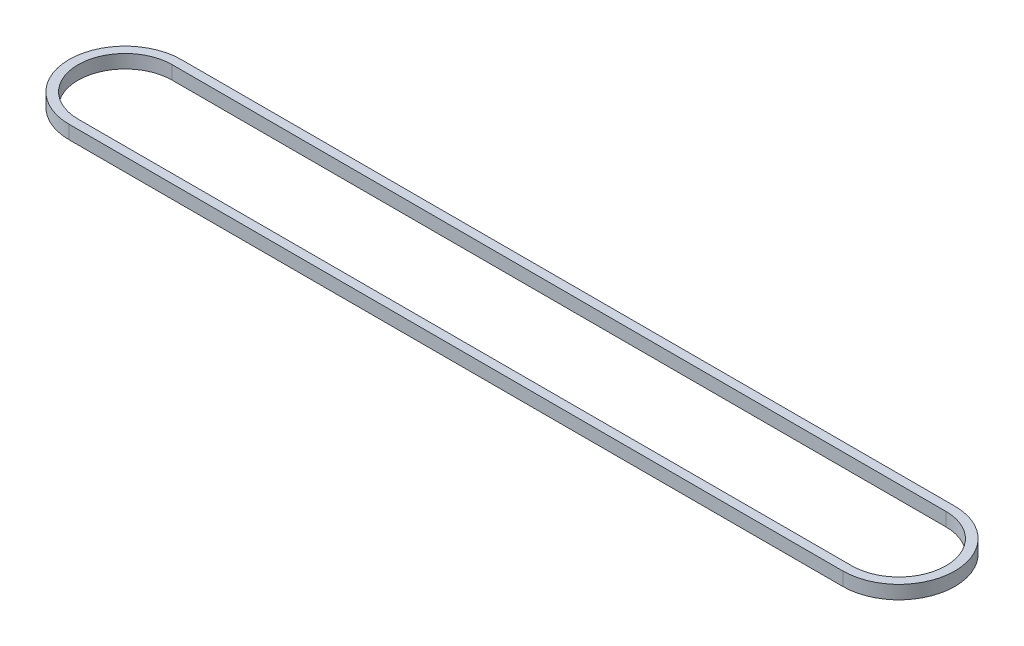
ISO-10303-21;
HEADER;
FILE_DESCRIPTION(('STEP AP214'),'2;1');
FILE_NAME('part.step','',(''),(''),'','','');
FILE_SCHEMA(('AUTOMOTIVE_DESIGN { 1 0 10303 214 1 1 1 1 }'));
ENDSEC;
DATA;
#1=APPLICATION_CONTEXT('core data for automotive mechanical design processes');
#2=APPLICATION_PROTOCOL_DEFINITION('international standard','automotive_design',2000,#1);
#3=PRODUCT_CONTEXT('',#1,'mechanical');
#4=PRODUCT('Part','Part','',(#3));
#5=PRODUCT_RELATED_PRODUCT_CATEGORY('part','',(#4));
#6=PRODUCT_DEFINITION_FORMATION('','',#4);
#7=PRODUCT_DEFINITION_CONTEXT('part definition',#1,'design');
#8=PRODUCT_DEFINITION('design','',#6,#7);
#9=PRODUCT_DEFINITION_SHAPE('','',#8);
#10=(LENGTH_UNIT() NAMED_UNIT(*) SI_UNIT(.MILLI.,.METRE.));
#11=(NAMED_UNIT(*) PLANE_ANGLE_UNIT() SI_UNIT($,.RADIAN.));
#12=(NAMED_UNIT(*) SI_UNIT($,.STERADIAN.) SOLID_ANGLE_UNIT());
#13=UNCERTAINTY_MEASURE_WITH_UNIT(LENGTH_MEASURE(1.E-05),#10,'distance_accuracy_value','');
#14=(GEOMETRIC_REPRESENTATION_CONTEXT(3) GLOBAL_UNCERTAINTY_ASSIGNED_CONTEXT((#13)) GLOBAL_UNIT_ASSIGNED_CONTEXT((#10,
#11,#12)) REPRESENTATION_CONTEXT('',''));
#15=CARTESIAN_POINT('',(0.,0.,0.));
#16=DIRECTION('',(0.,0.,1.));
#17=DIRECTION('',(1.,0.,0.));
#18=AXIS2_PLACEMENT_3D('',#15,#16,#17);
#19=CARTESIAN_POINT('',(-32.6689284068016,3.,0.));
#20=DIRECTION('',(0.,1.,0.));
#21=DIRECTION('',(0.,0.,1.));
#22=AXIS2_PLACEMENT_3D('',#19,#20,#21);
#23=PLANE('',#22);
#24=CARTESIAN_POINT('',(-32.6689284068016,3.,0.));
#25=DIRECTION('',(0.,1.,0.));
#26=DIRECTION('',(0.,0.,1.));
#27=AXIS2_PLACEMENT_3D('',#24,#25,#26);
#28=CIRCLE('',#27,12.5);
#29=CARTESIAN_POINT('',(-32.6689284068016,3.,-12.5));
#30=VERTEX_POINT('',#29);
#31=CARTESIAN_POINT('',(-32.6689284068016,3.,12.5));
#32=VERTEX_POINT('',#31);
#33=EDGE_CURVE('E133',#30,#32,#28,.T.);
#34=ORIENTED_EDGE('',*,*,#33,.T.);
#35=DIRECTION('',(1.,0.,0.));
#36=VECTOR('',#35,1.);
#37=CARTESIAN_POINT('',(-32.6689284068016,3.,12.5));
#38=LINE('',#37,#36);
#39=CARTESIAN_POINT('',(139.831071593198,3.,12.5));
#40=VERTEX_POINT('',#39);
#41=EDGE_CURVE('E136',#32,#40,#38,.T.);
#42=ORIENTED_EDGE('',*,*,#41,.T.);
#43=CARTESIAN_POINT('',(139.831071593198,3.,0.));
#44=DIRECTION('',(0.,1.,0.));
#45=DIRECTION('',(0.,0.,1.));
#46=AXIS2_PLACEMENT_3D('',#43,#44,#45);
#47=CIRCLE('',#46,12.5);
#48=CARTESIAN_POINT('',(139.831071593198,3.,-12.5));
#49=VERTEX_POINT('',#48);
#50=EDGE_CURVE('E139',#40,#49,#47,.T.);
#51=ORIENTED_EDGE('',*,*,#50,.T.);
#52=DIRECTION('',(-1.,0.,0.));
#53=VECTOR('',#52,1.);
#54=CARTESIAN_POINT('',(-32.6689284068016,3.,-12.5));
#55=LINE('',#54,#53);
#56=EDGE_CURVE('E141',#49,#30,#55,.T.);
#57=ORIENTED_EDGE('',*,*,#56,.T.);
#58=EDGE_LOOP('',(#34,#42,#51,#57));
#59=FACE_BOUND('',#58,.T.);
#60=DIRECTION('',(1.,0.,0.));
#61=VECTOR('',#60,1.);
#62=CARTESIAN_POINT('',(-32.6689284068016,3.,10.5));
#63=LINE('',#62,#61);
#64=CARTESIAN_POINT('',(-32.6689284068016,3.,10.5));
#65=VERTEX_POINT('',#64);
#66=CARTESIAN_POINT('',(139.831071593198,3.,10.5));
#67=VERTEX_POINT('',#66);
#68=EDGE_CURVE('E105',#65,#67,#63,.T.);
#69=ORIENTED_EDGE('',*,*,#68,.F.);
#70=CARTESIAN_POINT('',(-32.6689284068016,3.,0.));
#71=DIRECTION('',(0.,1.,0.));
#72=DIRECTION('',(0.,0.,1.));
#73=AXIS2_PLACEMENT_3D('',#70,#71,#72);
#74=CIRCLE('',#73,10.5);
#75=CARTESIAN_POINT('',(-32.6689284068016,3.,-10.5));
#76=VERTEX_POINT('',#75);
#77=EDGE_CURVE('E97',#76,#65,#74,.T.);
#78=ORIENTED_EDGE('',*,*,#77,.F.);
#79=DIRECTION('',(-1.,0.,0.));
#80=VECTOR('',#79,1.);
#81=CARTESIAN_POINT('',(-32.6689284068016,3.,-10.5));
#82=LINE('',#81,#80);
#83=CARTESIAN_POINT('',(139.831071593198,3.,-10.5));
#84=VERTEX_POINT('',#83);
#85=EDGE_CURVE('E119',#84,#76,#82,.T.);
#86=ORIENTED_EDGE('',*,*,#85,.F.);
#87=CARTESIAN_POINT('',(139.831071593198,3.,0.));
#88=DIRECTION('',(0.,1.,0.));
#89=DIRECTION('',(0.,0.,1.));
#90=AXIS2_PLACEMENT_3D('',#87,#88,#89);
#91=CIRCLE('',#90,10.5);
#92=EDGE_CURVE('E117',#67,#84,#91,.T.);
#93=ORIENTED_EDGE('',*,*,#92,.F.);
#94=EDGE_LOOP('',(#69,#78,#86,#93));
#95=FACE_BOUND('',#94,.T.);
#96=ADVANCED_FACE('F32',(#59,#95),#23,.T.);
#97=CARTESIAN_POINT('',(-32.6689284068016,0.,0.));
#98=DIRECTION('',(0.,1.,0.));
#99=DIRECTION('',(0.,0.,1.));
#100=AXIS2_PLACEMENT_3D('',#97,#98,#99);
#101=PLANE('',#100);
#102=CARTESIAN_POINT('',(-32.6689284068016,0.,0.));
#103=DIRECTION('',(0.,1.,0.));
#104=DIRECTION('',(0.,0.,1.));
#105=AXIS2_PLACEMENT_3D('',#102,#103,#104);
#106=CIRCLE('',#105,12.5);
#107=CARTESIAN_POINT('',(-32.6689284068016,0.,-12.5));
#108=VERTEX_POINT('',#107);
#109=CARTESIAN_POINT('',(-32.6689284068016,0.,12.5));
#110=VERTEX_POINT('',#109);
#111=EDGE_CURVE('E113',#108,#110,#106,.T.);
#112=ORIENTED_EDGE('',*,*,#111,.F.);
#113=DIRECTION('',(-1.,0.,0.));
#114=VECTOR('',#113,1.);
#115=CARTESIAN_POINT('',(-32.6689284068016,0.,-12.5));
#116=LINE('',#115,#114);
#117=CARTESIAN_POINT('',(139.831071593198,0.,-12.5));
#118=VERTEX_POINT('',#117);
#119=EDGE_CURVE('E137',#118,#108,#116,.T.);
#120=ORIENTED_EDGE('',*,*,#119,.F.);
#121=CARTESIAN_POINT('',(139.831071593198,0.,0.));
#122=DIRECTION('',(0.,1.,0.));
#123=DIRECTION('',(0.,0.,1.));
#124=AXIS2_PLACEMENT_3D('',#121,#122,#123);
#125=CIRCLE('',#124,12.5);
#126=CARTESIAN_POINT('',(139.831071593198,0.,12.5));
#127=VERTEX_POINT('',#126);
#128=EDGE_CURVE('E148',#127,#118,#125,.T.);
#129=ORIENTED_EDGE('',*,*,#128,.F.);
#130=DIRECTION('',(1.,0.,0.));
#131=VECTOR('',#130,1.);
#132=CARTESIAN_POINT('',(-32.6689284068016,0.,12.5));
#133=LINE('',#132,#131);
#134=EDGE_CURVE('E146',#110,#127,#133,.T.);
#135=ORIENTED_EDGE('',*,*,#134,.F.);
#136=EDGE_LOOP('',(#112,#120,#129,#135));
#137=FACE_BOUND('',#136,.T.);
#138=CARTESIAN_POINT('',(-32.6689284068016,0.,0.));
#139=DIRECTION('',(0.,1.,0.));
#140=DIRECTION('',(0.,0.,1.));
#141=AXIS2_PLACEMENT_3D('',#138,#139,#140);
#142=CIRCLE('',#141,10.5);
#143=CARTESIAN_POINT('',(-32.6689284068016,0.,-10.5));
#144=VERTEX_POINT('',#143);
#145=CARTESIAN_POINT('',(-32.6689284068016,0.,10.5));
#146=VERTEX_POINT('',#145);
#147=EDGE_CURVE('E55',#144,#146,#142,.T.);
#148=ORIENTED_EDGE('',*,*,#147,.T.);
#149=DIRECTION('',(1.,0.,0.));
#150=VECTOR('',#149,1.);
#151=CARTESIAN_POINT('',(-32.6689284068016,0.,10.5));
#152=LINE('',#151,#150);
#153=CARTESIAN_POINT('',(139.831071593198,0.,10.5));
#154=VERTEX_POINT('',#153);
#155=EDGE_CURVE('E112',#146,#154,#152,.T.);
#156=ORIENTED_EDGE('',*,*,#155,.T.);
#157=CARTESIAN_POINT('',(139.831071593198,0.,0.));
#158=DIRECTION('',(0.,1.,0.));
#159=DIRECTION('',(0.,0.,1.));
#160=AXIS2_PLACEMENT_3D('',#157,#158,#159);
#161=CIRCLE('',#160,10.5);
#162=CARTESIAN_POINT('',(139.831071593198,0.,-10.5));
#163=VERTEX_POINT('',#162);
#164=EDGE_CURVE('E125',#154,#163,#161,.T.);
#165=ORIENTED_EDGE('',*,*,#164,.T.);
#166=DIRECTION('',(-1.,0.,0.));
#167=VECTOR('',#166,1.);
#168=CARTESIAN_POINT('',(-32.6689284068016,0.,-10.5));
#169=LINE('',#168,#167);
#170=EDGE_CURVE('E106',#163,#144,#169,.T.);
#171=ORIENTED_EDGE('',*,*,#170,.T.);
#172=EDGE_LOOP('',(#148,#156,#165,#171));
#173=FACE_BOUND('',#172,.T.);
#174=ADVANCED_FACE('F166',(#137,#173),#101,.F.);
#175=CARTESIAN_POINT('',(-32.6689284068016,3.,0.));
#176=DIRECTION('',(0.,-1.,0.));
#177=DIRECTION('',(0.,0.,-1.));
#178=AXIS2_PLACEMENT_3D('',#175,#176,#177);
#179=CYLINDRICAL_SURFACE('',#178,12.5);
#180=ORIENTED_EDGE('',*,*,#111,.T.);
#181=DIRECTION('',(0.,-1.,0.));
#182=VECTOR('',#181,1.);
#183=CARTESIAN_POINT('',(-32.6689284068016,3.,12.5));
#184=LINE('',#183,#182);
#185=EDGE_CURVE('E11',#32,#110,#184,.T.);
#186=ORIENTED_EDGE('',*,*,#185,.F.);
#187=ORIENTED_EDGE('',*,*,#33,.F.);
#188=DIRECTION('',(0.,-1.,0.));
#189=VECTOR('',#188,1.);
#190=CARTESIAN_POINT('',(-32.6689284068016,3.,-12.5));
#191=LINE('',#190,#189);
#192=EDGE_CURVE('E143',#30,#108,#191,.T.);
#193=ORIENTED_EDGE('',*,*,#192,.T.);
#194=EDGE_LOOP('',(#180,#186,#187,#193));
#195=FACE_BOUND('',#194,.T.);
#196=ADVANCED_FACE('F34',(#195),#179,.T.);
#197=CARTESIAN_POINT('',(-32.6689284068016,3.,12.5));
#198=DIRECTION('',(0.,0.,-1.));
#199=DIRECTION('',(-1.,0.,0.));
#200=AXIS2_PLACEMENT_3D('',#197,#198,#199);
#201=PLANE('',#200);
#202=ORIENTED_EDGE('',*,*,#134,.T.);
#203=DIRECTION('',(0.,-1.,0.));
#204=VECTOR('',#203,1.);
#205=CARTESIAN_POINT('',(139.831071593198,3.,12.5));
#206=LINE('',#205,#204);
#207=EDGE_CURVE('E40',#40,#127,#206,.T.);
#208=ORIENTED_EDGE('',*,*,#207,.F.);
#209=ORIENTED_EDGE('',*,*,#41,.F.);
#210=ORIENTED_EDGE('',*,*,#185,.T.);
#211=EDGE_LOOP('',(#202,#208,#209,#210));
#212=FACE_BOUND('',#211,.T.);
#213=ADVANCED_FACE('F176',(#212),#201,.F.);
#214=CARTESIAN_POINT('',(139.831071593198,3.,0.));
#215=DIRECTION('',(0.,-1.,0.));
#216=DIRECTION('',(0.,0.,-1.));
#217=AXIS2_PLACEMENT_3D('',#214,#215,#216);
#218=CYLINDRICAL_SURFACE('',#217,12.5);
#219=ORIENTED_EDGE('',*,*,#128,.T.);
#220=DIRECTION('',(0.,-1.,0.));
#221=VECTOR('',#220,1.);
#222=CARTESIAN_POINT('',(139.831071593198,3.,-12.5));
#223=LINE('',#222,#221);
#224=EDGE_CURVE('E153',#49,#118,#223,.T.);
#225=ORIENTED_EDGE('',*,*,#224,.F.);
#226=ORIENTED_EDGE('',*,*,#50,.F.);
#227=ORIENTED_EDGE('',*,*,#207,.T.);
#228=EDGE_LOOP('',(#219,#225,#226,#227));
#229=FACE_BOUND('',#228,.T.);
#230=ADVANCED_FACE('F160',(#229),#218,.T.);
#231=CARTESIAN_POINT('',(-32.6689284068016,3.,-12.5));
#232=DIRECTION('',(0.,0.,1.));
#233=DIRECTION('',(1.,0.,0.));
#234=AXIS2_PLACEMENT_3D('',#231,#232,#233);
#235=PLANE('',#234);
#236=ORIENTED_EDGE('',*,*,#119,.T.);
#237=ORIENTED_EDGE('',*,*,#192,.F.);
#238=ORIENTED_EDGE('',*,*,#56,.F.);
#239=ORIENTED_EDGE('',*,*,#224,.T.);
#240=EDGE_LOOP('',(#236,#237,#238,#239));
#241=FACE_BOUND('',#240,.T.);
#242=ADVANCED_FACE('F170',(#241),#235,.F.);
#243=CARTESIAN_POINT('',(-32.6689284068016,3.,0.));
#244=DIRECTION('',(0.,-1.,0.));
#245=DIRECTION('',(0.,0.,-1.));
#246=AXIS2_PLACEMENT_3D('',#243,#244,#245);
#247=CYLINDRICAL_SURFACE('',#246,10.5);
#248=ORIENTED_EDGE('',*,*,#147,.F.);
#249=DIRECTION('',(0.,-1.,0.));
#250=VECTOR('',#249,1.);
#251=CARTESIAN_POINT('',(-32.6689284068016,3.,-10.5));
#252=LINE('',#251,#250);
#253=EDGE_CURVE('E101',#76,#144,#252,.T.);
#254=ORIENTED_EDGE('',*,*,#253,.F.);
#255=ORIENTED_EDGE('',*,*,#77,.T.);
#256=DIRECTION('',(0.,-1.,0.));
#257=VECTOR('',#256,1.);
#258=CARTESIAN_POINT('',(-32.6689284068016,3.,10.5));
#259=LINE('',#258,#257);
#260=EDGE_CURVE('E100',#65,#146,#259,.T.);
#261=ORIENTED_EDGE('',*,*,#260,.T.);
#262=EDGE_LOOP('',(#248,#254,#255,#261));
#263=FACE_BOUND('',#262,.T.);
#264=ADVANCED_FACE('F99',(#263),#247,.F.);
#265=CARTESIAN_POINT('',(-32.6689284068016,3.,10.5));
#266=DIRECTION('',(0.,0.,-1.));
#267=DIRECTION('',(-1.,0.,0.));
#268=AXIS2_PLACEMENT_3D('',#265,#266,#267);
#269=PLANE('',#268);
#270=ORIENTED_EDGE('',*,*,#155,.F.);
#271=ORIENTED_EDGE('',*,*,#260,.F.);
#272=ORIENTED_EDGE('',*,*,#68,.T.);
#273=DIRECTION('',(0.,-1.,0.));
#274=VECTOR('',#273,1.);
#275=CARTESIAN_POINT('',(139.831071593198,3.,10.5));
#276=LINE('',#275,#274);
#277=EDGE_CURVE('E114',#67,#154,#276,.T.);
#278=ORIENTED_EDGE('',*,*,#277,.T.);
#279=EDGE_LOOP('',(#270,#271,#272,#278));
#280=FACE_BOUND('',#279,.T.);
#281=ADVANCED_FACE('F109',(#280),#269,.T.);
#282=CARTESIAN_POINT('',(139.831071593198,3.,0.));
#283=DIRECTION('',(0.,-1.,0.));
#284=DIRECTION('',(0.,0.,-1.));
#285=AXIS2_PLACEMENT_3D('',#282,#283,#284);
#286=CYLINDRICAL_SURFACE('',#285,10.5);
#287=ORIENTED_EDGE('',*,*,#164,.F.);
#288=ORIENTED_EDGE('',*,*,#277,.F.);
#289=ORIENTED_EDGE('',*,*,#92,.T.);
#290=DIRECTION('',(0.,-1.,0.));
#291=VECTOR('',#290,1.);
#292=CARTESIAN_POINT('',(139.831071593198,3.,-10.5));
#293=LINE('',#292,#291);
#294=EDGE_CURVE('E47',#84,#163,#293,.T.);
#295=ORIENTED_EDGE('',*,*,#294,.T.);
#296=EDGE_LOOP('',(#287,#288,#289,#295));
#297=FACE_BOUND('',#296,.T.);
#298=ADVANCED_FACE('F199',(#297),#286,.F.);
#299=CARTESIAN_POINT('',(-32.6689284068016,3.,-10.5));
#300=DIRECTION('',(0.,0.,1.));
#301=DIRECTION('',(1.,0.,0.));
#302=AXIS2_PLACEMENT_3D('',#299,#300,#301);
#303=PLANE('',#302);
#304=ORIENTED_EDGE('',*,*,#170,.F.);
#305=ORIENTED_EDGE('',*,*,#294,.F.);
#306=ORIENTED_EDGE('',*,*,#85,.T.);
#307=ORIENTED_EDGE('',*,*,#253,.T.);
#308=EDGE_LOOP('',(#304,#305,#306,#307));
#309=FACE_BOUND('',#308,.T.);
#310=ADVANCED_FACE('F203',(#309),#303,.T.);
#311=CLOSED_SHELL('',(#96,#174,#196,#213,#230,#242,#264,#281,#298,#310));
#312=MANIFOLD_SOLID_BREP('B2',#311);
#313=ADVANCED_BREP_SHAPE_REPRESENTATION('',(#18,#312),#14);
#314=SHAPE_DEFINITION_REPRESENTATION(#9,#313);
ENDSEC;
END-ISO-10303-21;
